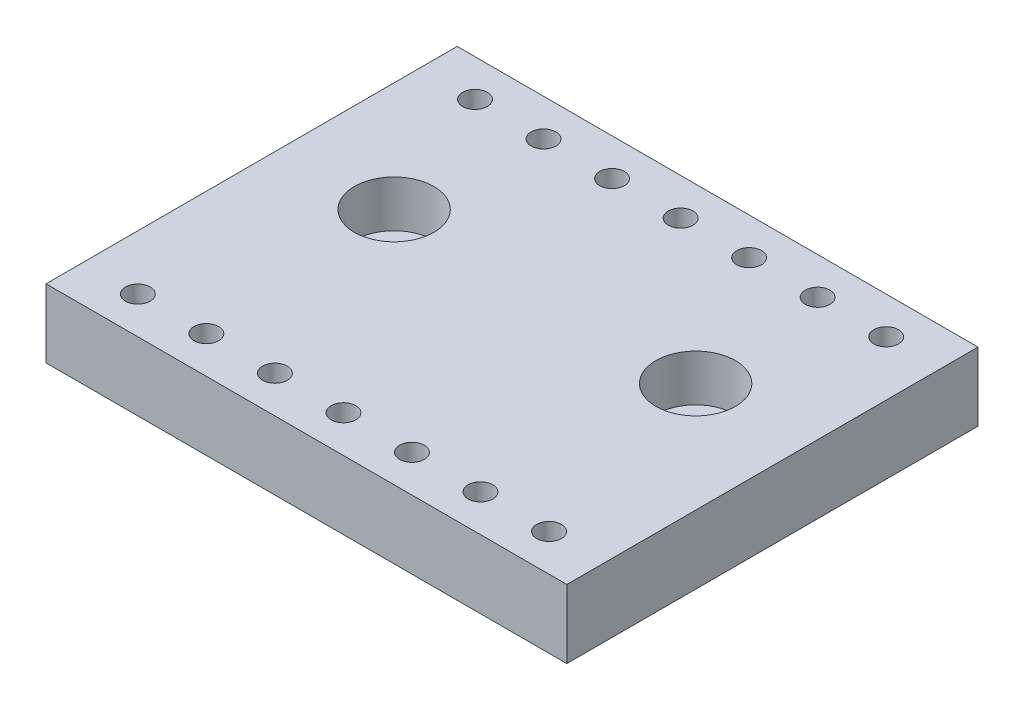
ISO-10303-21;
HEADER;
FILE_DESCRIPTION(('STEP AP214'),'2;1');
FILE_NAME('part.step','',(''),(''),'','','');
FILE_SCHEMA(('AUTOMOTIVE_DESIGN { 1 0 10303 214 1 1 1 1 }'));
ENDSEC;
DATA;
#1=APPLICATION_CONTEXT('core data for automotive mechanical design processes');
#2=APPLICATION_PROTOCOL_DEFINITION('international standard','automotive_design',2000,#1);
#3=PRODUCT_CONTEXT('',#1,'mechanical');
#4=PRODUCT('Part','Part','',(#3));
#5=PRODUCT_RELATED_PRODUCT_CATEGORY('part','',(#4));
#6=PRODUCT_DEFINITION_FORMATION('','',#4);
#7=PRODUCT_DEFINITION_CONTEXT('part definition',#1,'design');
#8=PRODUCT_DEFINITION('design','',#6,#7);
#9=PRODUCT_DEFINITION_SHAPE('','',#8);
#10=(LENGTH_UNIT() NAMED_UNIT(*) SI_UNIT(.MILLI.,.METRE.));
#11=(NAMED_UNIT(*) PLANE_ANGLE_UNIT() SI_UNIT($,.RADIAN.));
#12=(NAMED_UNIT(*) SI_UNIT($,.STERADIAN.) SOLID_ANGLE_UNIT());
#13=UNCERTAINTY_MEASURE_WITH_UNIT(LENGTH_MEASURE(1.E-05),#10,'distance_accuracy_value','');
#14=(GEOMETRIC_REPRESENTATION_CONTEXT(3) GLOBAL_UNCERTAINTY_ASSIGNED_CONTEXT((#13)) GLOBAL_UNIT_ASSIGNED_CONTEXT((#10,
#11,#12)) REPRESENTATION_CONTEXT('',''));
#15=CARTESIAN_POINT('',(0.,0.,0.));
#16=DIRECTION('',(0.,0.,1.));
#17=DIRECTION('',(1.,0.,0.));
#18=AXIS2_PLACEMENT_3D('',#15,#16,#17);
#19=CARTESIAN_POINT('',(24.13,-6.35,-19.05));
#20=DIRECTION('',(1.,0.,0.));
#21=DIRECTION('',(0.,0.,-1.));
#22=AXIS2_PLACEMENT_3D('',#19,#20,#21);
#23=PLANE('',#22);
#24=DIRECTION('',(0.,0.,-1.));
#25=VECTOR('',#24,1.);
#26=CARTESIAN_POINT('',(24.13,0.,-19.05));
#27=LINE('',#26,#25);
#28=CARTESIAN_POINT('',(24.13,0.,19.05));
#29=VERTEX_POINT('',#28);
#30=CARTESIAN_POINT('',(24.13,0.,-19.05));
#31=VERTEX_POINT('',#30);
#32=EDGE_CURVE('E105',#29,#31,#27,.T.);
#33=ORIENTED_EDGE('',*,*,#32,.F.);
#34=DIRECTION('',(0.,1.,0.));
#35=VECTOR('',#34,1.);
#36=CARTESIAN_POINT('',(24.13,-6.35,19.05));
#37=LINE('',#36,#35);
#38=CARTESIAN_POINT('',(24.13,-6.35,19.05));
#39=VERTEX_POINT('',#38);
#40=EDGE_CURVE('E52',#39,#29,#37,.T.);
#41=ORIENTED_EDGE('',*,*,#40,.F.);
#42=DIRECTION('',(0.,0.,-1.));
#43=VECTOR('',#42,1.);
#44=CARTESIAN_POINT('',(24.13,-6.35,-19.05));
#45=LINE('',#44,#43);
#46=CARTESIAN_POINT('',(24.13,-6.35,-19.05));
#47=VERTEX_POINT('',#46);
#48=EDGE_CURVE('E98',#39,#47,#45,.T.);
#49=ORIENTED_EDGE('',*,*,#48,.T.);
#50=DIRECTION('',(0.,1.,0.));
#51=VECTOR('',#50,1.);
#52=CARTESIAN_POINT('',(24.13,-6.35,-19.05));
#53=LINE('',#52,#51);
#54=EDGE_CURVE('E80',#47,#31,#53,.T.);
#55=ORIENTED_EDGE('',*,*,#54,.T.);
#56=EDGE_LOOP('',(#33,#41,#49,#55));
#57=FACE_BOUND('',#56,.T.);
#58=ADVANCED_FACE('F35',(#57),#23,.T.);
#59=CARTESIAN_POINT('',(-24.13,-6.35,19.05));
#60=DIRECTION('',(0.,0.,1.));
#61=DIRECTION('',(1.,0.,0.));
#62=AXIS2_PLACEMENT_3D('',#59,#60,#61);
#63=PLANE('',#62);
#64=DIRECTION('',(1.,0.,0.));
#65=VECTOR('',#64,1.);
#66=CARTESIAN_POINT('',(-24.13,0.,19.05));
#67=LINE('',#66,#65);
#68=CARTESIAN_POINT('',(-24.13,0.,19.05));
#69=VERTEX_POINT('',#68);
#70=EDGE_CURVE('E100',#69,#29,#67,.T.);
#71=ORIENTED_EDGE('',*,*,#70,.F.);
#72=DIRECTION('',(0.,1.,0.));
#73=VECTOR('',#72,1.);
#74=CARTESIAN_POINT('',(-24.13,-6.35,19.05));
#75=LINE('',#74,#73);
#76=CARTESIAN_POINT('',(-24.13,-6.35,19.05));
#77=VERTEX_POINT('',#76);
#78=EDGE_CURVE('E69',#77,#69,#75,.T.);
#79=ORIENTED_EDGE('',*,*,#78,.F.);
#80=DIRECTION('',(1.,0.,0.));
#81=VECTOR('',#80,1.);
#82=CARTESIAN_POINT('',(-24.13,-6.35,19.05));
#83=LINE('',#82,#81);
#84=EDGE_CURVE('E95',#77,#39,#83,.T.);
#85=ORIENTED_EDGE('',*,*,#84,.T.);
#86=ORIENTED_EDGE('',*,*,#40,.T.);
#87=EDGE_LOOP('',(#71,#79,#85,#86));
#88=FACE_BOUND('',#87,.T.);
#89=ADVANCED_FACE('F193',(#88),#63,.T.);
#90=CARTESIAN_POINT('',(-24.13,-6.35,-19.05));
#91=DIRECTION('',(-1.,0.,0.));
#92=DIRECTION('',(0.,0.,1.));
#93=AXIS2_PLACEMENT_3D('',#90,#91,#92);
#94=PLANE('',#93);
#95=DIRECTION('',(0.,0.,1.));
#96=VECTOR('',#95,1.);
#97=CARTESIAN_POINT('',(-24.13,0.,-19.05));
#98=LINE('',#97,#96);
#99=CARTESIAN_POINT('',(-24.13,0.,-19.05));
#100=VERTEX_POINT('',#99);
#101=EDGE_CURVE('E88',#100,#69,#98,.T.);
#102=ORIENTED_EDGE('',*,*,#101,.F.);
#103=DIRECTION('',(0.,1.,0.));
#104=VECTOR('',#103,1.);
#105=CARTESIAN_POINT('',(-24.13,-6.35,-19.05));
#106=LINE('',#105,#104);
#107=CARTESIAN_POINT('',(-24.13,-6.35,-19.05));
#108=VERTEX_POINT('',#107);
#109=EDGE_CURVE('E83',#108,#100,#106,.T.);
#110=ORIENTED_EDGE('',*,*,#109,.F.);
#111=DIRECTION('',(0.,0.,1.));
#112=VECTOR('',#111,1.);
#113=CARTESIAN_POINT('',(-24.13,-6.35,-19.05));
#114=LINE('',#113,#112);
#115=EDGE_CURVE('E86',#108,#77,#114,.T.);
#116=ORIENTED_EDGE('',*,*,#115,.T.);
#117=ORIENTED_EDGE('',*,*,#78,.T.);
#118=EDGE_LOOP('',(#102,#110,#116,#117));
#119=FACE_BOUND('',#118,.T.);
#120=ADVANCED_FACE('F85',(#119),#94,.T.);
#121=CARTESIAN_POINT('',(-24.13,-6.35,-19.05));
#122=DIRECTION('',(0.,0.,-1.));
#123=DIRECTION('',(-1.,0.,0.));
#124=AXIS2_PLACEMENT_3D('',#121,#122,#123);
#125=PLANE('',#124);
#126=DIRECTION('',(-1.,0.,0.));
#127=VECTOR('',#126,1.);
#128=CARTESIAN_POINT('',(-24.13,0.,-19.05));
#129=LINE('',#128,#127);
#130=EDGE_CURVE('E108',#31,#100,#129,.T.);
#131=ORIENTED_EDGE('',*,*,#130,.F.);
#132=ORIENTED_EDGE('',*,*,#54,.F.);
#133=DIRECTION('',(-1.,0.,0.));
#134=VECTOR('',#133,1.);
#135=CARTESIAN_POINT('',(-24.13,-6.35,-19.05));
#136=LINE('',#135,#134);
#137=EDGE_CURVE('E94',#47,#108,#136,.T.);
#138=ORIENTED_EDGE('',*,*,#137,.T.);
#139=ORIENTED_EDGE('',*,*,#109,.T.);
#140=EDGE_LOOP('',(#131,#132,#138,#139));
#141=FACE_BOUND('',#140,.T.);
#142=ADVANCED_FACE('F97',(#141),#125,.T.);
#143=CARTESIAN_POINT('',(0.,-6.35,0.));
#144=DIRECTION('',(0.,1.,0.));
#145=DIRECTION('',(0.,0.,1.));
#146=AXIS2_PLACEMENT_3D('',#143,#144,#145);
#147=PLANE('',#146);
#148=CARTESIAN_POINT('',(13.97,-6.35,-3.048));
#149=DIRECTION('',(0.,1.,0.));
#150=DIRECTION('',(0.,0.,1.));
#151=AXIS2_PLACEMENT_3D('',#148,#149,#150);
#152=CIRCLE('',#151,2.159);
#153=CARTESIAN_POINT('',(13.97,-6.35,-0.888999999999999));
#154=VERTEX_POINT('',#153);
#155=EDGE_CURVE('E327',#154,#154,#152,.F.);
#156=ORIENTED_EDGE('',*,*,#155,.F.);
#157=EDGE_LOOP('',(#156));
#158=FACE_BOUND('',#157,.T.);
#159=CARTESIAN_POINT('',(-12.7,-6.35,-15.621));
#160=DIRECTION('',(0.,1.,0.));
#161=DIRECTION('',(0.,0.,1.));
#162=AXIS2_PLACEMENT_3D('',#159,#160,#161);
#163=CIRCLE('',#162,1.143);
#164=CARTESIAN_POINT('',(-12.7,-6.35,-14.478));
#165=VERTEX_POINT('',#164);
#166=EDGE_CURVE('E318',#165,#165,#163,.T.);
#167=ORIENTED_EDGE('',*,*,#166,.T.);
#168=EDGE_LOOP('',(#167));
#169=FACE_BOUND('',#168,.T.);
#170=CARTESIAN_POINT('',(-12.7,-6.35,15.621));
#171=DIRECTION('',(0.,1.,0.));
#172=DIRECTION('',(0.,0.,1.));
#173=AXIS2_PLACEMENT_3D('',#170,#171,#172);
#174=CIRCLE('',#173,1.143);
#175=CARTESIAN_POINT('',(-12.7,-6.35,16.764));
#176=VERTEX_POINT('',#175);
#177=EDGE_CURVE('E312',#176,#176,#174,.T.);
#178=ORIENTED_EDGE('',*,*,#177,.T.);
#179=EDGE_LOOP('',(#178));
#180=FACE_BOUND('',#179,.T.);
#181=CARTESIAN_POINT('',(-19.05,-6.35,15.621));
#182=DIRECTION('',(0.,1.,0.));
#183=DIRECTION('',(0.,0.,1.));
#184=AXIS2_PLACEMENT_3D('',#181,#182,#183);
#185=CIRCLE('',#184,1.143);
#186=CARTESIAN_POINT('',(-19.05,-6.35,16.764));
#187=VERTEX_POINT('',#186);
#188=EDGE_CURVE('E306',#187,#187,#185,.T.);
#189=ORIENTED_EDGE('',*,*,#188,.T.);
#190=EDGE_LOOP('',(#189));
#191=FACE_BOUND('',#190,.T.);
#192=CARTESIAN_POINT('',(-19.05,-6.35,-15.621));
#193=DIRECTION('',(0.,1.,0.));
#194=DIRECTION('',(0.,0.,1.));
#195=AXIS2_PLACEMENT_3D('',#192,#193,#194);
#196=CIRCLE('',#195,1.143);
#197=CARTESIAN_POINT('',(-19.05,-6.35,-14.478));
#198=VERTEX_POINT('',#197);
#199=EDGE_CURVE('E300',#198,#198,#196,.T.);
#200=ORIENTED_EDGE('',*,*,#199,.T.);
#201=EDGE_LOOP('',(#200));
#202=FACE_BOUND('',#201,.T.);
#203=CARTESIAN_POINT('',(-13.97,-6.35,-3.048));
#204=DIRECTION('',(0.,1.,0.));
#205=DIRECTION('',(0.,0.,1.));
#206=AXIS2_PLACEMENT_3D('',#203,#204,#205);
#207=CIRCLE('',#206,2.159);
#208=CARTESIAN_POINT('',(-13.97,-6.35,-0.888999999999999));
#209=VERTEX_POINT('',#208);
#210=EDGE_CURVE('E295',#209,#209,#207,.T.);
#211=ORIENTED_EDGE('',*,*,#210,.T.);
#212=EDGE_LOOP('',(#211));
#213=FACE_BOUND('',#212,.T.);
#214=ORIENTED_EDGE('',*,*,#48,.F.);
#215=ORIENTED_EDGE('',*,*,#84,.F.);
#216=ORIENTED_EDGE('',*,*,#115,.F.);
#217=ORIENTED_EDGE('',*,*,#137,.F.);
#218=EDGE_LOOP('',(#214,#215,#216,#217));
#219=FACE_BOUND('',#218,.T.);
#220=CARTESIAN_POINT('',(-6.35,-6.35,15.621));
#221=DIRECTION('',(0.,1.,0.));
#222=DIRECTION('',(0.,0.,1.));
#223=AXIS2_PLACEMENT_3D('',#220,#221,#222);
#224=CIRCLE('',#223,1.143);
#225=CARTESIAN_POINT('',(-6.35,-6.35,16.764));
#226=VERTEX_POINT('',#225);
#227=EDGE_CURVE('E120',#226,#226,#224,.T.);
#228=ORIENTED_EDGE('',*,*,#227,.T.);
#229=EDGE_LOOP('',(#228));
#230=FACE_BOUND('',#229,.T.);
#231=CARTESIAN_POINT('',(0.,-6.35,15.621));
#232=DIRECTION('',(0.,1.,0.));
#233=DIRECTION('',(0.,0.,1.));
#234=AXIS2_PLACEMENT_3D('',#231,#232,#233);
#235=CIRCLE('',#234,1.143);
#236=CARTESIAN_POINT('',(0.,-6.35,16.764));
#237=VERTEX_POINT('',#236);
#238=EDGE_CURVE('E126',#237,#237,#235,.T.);
#239=ORIENTED_EDGE('',*,*,#238,.T.);
#240=EDGE_LOOP('',(#239));
#241=FACE_BOUND('',#240,.T.);
#242=CARTESIAN_POINT('',(6.35,-6.35,15.621));
#243=DIRECTION('',(0.,1.,0.));
#244=DIRECTION('',(0.,0.,1.));
#245=AXIS2_PLACEMENT_3D('',#242,#243,#244);
#246=CIRCLE('',#245,1.143);
#247=CARTESIAN_POINT('',(6.35,-6.35,16.764));
#248=VERTEX_POINT('',#247);
#249=EDGE_CURVE('E132',#248,#248,#246,.T.);
#250=ORIENTED_EDGE('',*,*,#249,.T.);
#251=EDGE_LOOP('',(#250));
#252=FACE_BOUND('',#251,.T.);
#253=CARTESIAN_POINT('',(12.7,-6.35,15.621));
#254=DIRECTION('',(0.,1.,0.));
#255=DIRECTION('',(0.,0.,1.));
#256=AXIS2_PLACEMENT_3D('',#253,#254,#255);
#257=CIRCLE('',#256,1.143);
#258=CARTESIAN_POINT('',(12.7,-6.35,16.764));
#259=VERTEX_POINT('',#258);
#260=EDGE_CURVE('E138',#259,#259,#257,.T.);
#261=ORIENTED_EDGE('',*,*,#260,.T.);
#262=EDGE_LOOP('',(#261));
#263=FACE_BOUND('',#262,.T.);
#264=CARTESIAN_POINT('',(19.05,-6.35,15.621));
#265=DIRECTION('',(0.,1.,0.));
#266=DIRECTION('',(0.,0.,1.));
#267=AXIS2_PLACEMENT_3D('',#264,#265,#266);
#268=CIRCLE('',#267,1.143);
#269=CARTESIAN_POINT('',(19.05,-6.35,16.764));
#270=VERTEX_POINT('',#269);
#271=EDGE_CURVE('E144',#270,#270,#268,.T.);
#272=ORIENTED_EDGE('',*,*,#271,.T.);
#273=EDGE_LOOP('',(#272));
#274=FACE_BOUND('',#273,.T.);
#275=CARTESIAN_POINT('',(-6.35,-6.35,-15.621));
#276=DIRECTION('',(0.,1.,0.));
#277=DIRECTION('',(0.,0.,1.));
#278=AXIS2_PLACEMENT_3D('',#275,#276,#277);
#279=CIRCLE('',#278,1.143);
#280=CARTESIAN_POINT('',(-6.35,-6.35,-14.478));
#281=VERTEX_POINT('',#280);
#282=EDGE_CURVE('E150',#281,#281,#279,.T.);
#283=ORIENTED_EDGE('',*,*,#282,.T.);
#284=EDGE_LOOP('',(#283));
#285=FACE_BOUND('',#284,.T.);
#286=CARTESIAN_POINT('',(0.,-6.35,-15.621));
#287=DIRECTION('',(0.,1.,0.));
#288=DIRECTION('',(0.,0.,1.));
#289=AXIS2_PLACEMENT_3D('',#286,#287,#288);
#290=CIRCLE('',#289,1.143);
#291=CARTESIAN_POINT('',(0.,-6.35,-14.478));
#292=VERTEX_POINT('',#291);
#293=EDGE_CURVE('E156',#292,#292,#290,.T.);
#294=ORIENTED_EDGE('',*,*,#293,.T.);
#295=EDGE_LOOP('',(#294));
#296=FACE_BOUND('',#295,.T.);
#297=CARTESIAN_POINT('',(6.35,-6.35,-15.621));
#298=DIRECTION('',(0.,1.,0.));
#299=DIRECTION('',(0.,0.,1.));
#300=AXIS2_PLACEMENT_3D('',#297,#298,#299);
#301=CIRCLE('',#300,1.143);
#302=CARTESIAN_POINT('',(6.35,-6.35,-14.478));
#303=VERTEX_POINT('',#302);
#304=EDGE_CURVE('E162',#303,#303,#301,.T.);
#305=ORIENTED_EDGE('',*,*,#304,.T.);
#306=EDGE_LOOP('',(#305));
#307=FACE_BOUND('',#306,.T.);
#308=CARTESIAN_POINT('',(12.7,-6.35,-15.621));
#309=DIRECTION('',(0.,1.,0.));
#310=DIRECTION('',(0.,0.,1.));
#311=AXIS2_PLACEMENT_3D('',#308,#309,#310);
#312=CIRCLE('',#311,1.143);
#313=CARTESIAN_POINT('',(12.7,-6.35,-14.478));
#314=VERTEX_POINT('',#313);
#315=EDGE_CURVE('E168',#314,#314,#312,.T.);
#316=ORIENTED_EDGE('',*,*,#315,.T.);
#317=EDGE_LOOP('',(#316));
#318=FACE_BOUND('',#317,.T.);
#319=CARTESIAN_POINT('',(19.05,-6.35,-15.621));
#320=DIRECTION('',(0.,1.,0.));
#321=DIRECTION('',(0.,0.,1.));
#322=AXIS2_PLACEMENT_3D('',#319,#320,#321);
#323=CIRCLE('',#322,1.143);
#324=CARTESIAN_POINT('',(19.05,-6.35,-14.478));
#325=VERTEX_POINT('',#324);
#326=EDGE_CURVE('E11',#325,#325,#323,.T.);
#327=ORIENTED_EDGE('',*,*,#326,.T.);
#328=EDGE_LOOP('',(#327));
#329=FACE_BOUND('',#328,.T.);
#330=ADVANCED_FACE('F92',(#158,#169,#180,#191,#202,#213,#219,#230,#241,#252,#263,#274,#285,#296,
#307,#318,#329),#147,.F.);
#331=CARTESIAN_POINT('',(0.,0.,0.));
#332=DIRECTION('',(0.,1.,0.));
#333=DIRECTION('',(0.,0.,1.));
#334=AXIS2_PLACEMENT_3D('',#331,#332,#333);
#335=PLANE('',#334);
#336=CARTESIAN_POINT('',(13.97,0.,-3.048));
#337=DIRECTION('',(0.,-1.,0.));
#338=DIRECTION('',(0.,0.,1.));
#339=AXIS2_PLACEMENT_3D('',#336,#337,#338);
#340=CIRCLE('',#339,3.683);
#341=CARTESIAN_POINT('',(13.97,0.,0.635000000000003));
#342=VERTEX_POINT('',#341);
#343=EDGE_CURVE('E325',#342,#342,#340,.T.);
#344=ORIENTED_EDGE('',*,*,#343,.T.);
#345=EDGE_LOOP('',(#344));
#346=FACE_BOUND('',#345,.T.);
#347=CARTESIAN_POINT('',(-12.7,0.,-15.621));
#348=DIRECTION('',(0.,1.,0.));
#349=DIRECTION('',(0.,0.,1.));
#350=AXIS2_PLACEMENT_3D('',#347,#348,#349);
#351=CIRCLE('',#350,1.143);
#352=CARTESIAN_POINT('',(-12.7,0.,-14.478));
#353=VERTEX_POINT('',#352);
#354=EDGE_CURVE('E321',#353,#353,#351,.T.);
#355=ORIENTED_EDGE('',*,*,#354,.F.);
#356=EDGE_LOOP('',(#355));
#357=FACE_BOUND('',#356,.T.);
#358=CARTESIAN_POINT('',(-12.7,0.,15.621));
#359=DIRECTION('',(0.,1.,0.));
#360=DIRECTION('',(0.,0.,1.));
#361=AXIS2_PLACEMENT_3D('',#358,#359,#360);
#362=CIRCLE('',#361,1.143);
#363=CARTESIAN_POINT('',(-12.7,0.,16.764));
#364=VERTEX_POINT('',#363);
#365=EDGE_CURVE('E315',#364,#364,#362,.T.);
#366=ORIENTED_EDGE('',*,*,#365,.F.);
#367=EDGE_LOOP('',(#366));
#368=FACE_BOUND('',#367,.T.);
#369=CARTESIAN_POINT('',(-19.05,0.,15.621));
#370=DIRECTION('',(0.,1.,0.));
#371=DIRECTION('',(0.,0.,1.));
#372=AXIS2_PLACEMENT_3D('',#369,#370,#371);
#373=CIRCLE('',#372,1.143);
#374=CARTESIAN_POINT('',(-19.05,0.,16.764));
#375=VERTEX_POINT('',#374);
#376=EDGE_CURVE('E309',#375,#375,#373,.T.);
#377=ORIENTED_EDGE('',*,*,#376,.F.);
#378=EDGE_LOOP('',(#377));
#379=FACE_BOUND('',#378,.T.);
#380=CARTESIAN_POINT('',(-19.05,0.,-15.621));
#381=DIRECTION('',(0.,1.,0.));
#382=DIRECTION('',(0.,0.,1.));
#383=AXIS2_PLACEMENT_3D('',#380,#381,#382);
#384=CIRCLE('',#383,1.143);
#385=CARTESIAN_POINT('',(-19.05,0.,-14.478));
#386=VERTEX_POINT('',#385);
#387=EDGE_CURVE('E303',#386,#386,#384,.T.);
#388=ORIENTED_EDGE('',*,*,#387,.F.);
#389=EDGE_LOOP('',(#388));
#390=FACE_BOUND('',#389,.T.);
#391=CARTESIAN_POINT('',(-13.97,0.,-3.048));
#392=DIRECTION('',(0.,1.,0.));
#393=DIRECTION('',(0.,0.,1.));
#394=AXIS2_PLACEMENT_3D('',#391,#392,#393);
#395=CIRCLE('',#394,3.683);
#396=CARTESIAN_POINT('',(-13.97,0.,0.635000000000003));
#397=VERTEX_POINT('',#396);
#398=EDGE_CURVE('E292',#397,#397,#395,.T.);
#399=ORIENTED_EDGE('',*,*,#398,.F.);
#400=EDGE_LOOP('',(#399));
#401=FACE_BOUND('',#400,.T.);
#402=ORIENTED_EDGE('',*,*,#32,.T.);
#403=ORIENTED_EDGE('',*,*,#130,.T.);
#404=ORIENTED_EDGE('',*,*,#101,.T.);
#405=ORIENTED_EDGE('',*,*,#70,.T.);
#406=EDGE_LOOP('',(#402,#403,#404,#405));
#407=FACE_BOUND('',#406,.T.);
#408=CARTESIAN_POINT('',(-6.35,0.,15.621));
#409=DIRECTION('',(0.,1.,0.));
#410=DIRECTION('',(0.,0.,1.));
#411=AXIS2_PLACEMENT_3D('',#408,#409,#410);
#412=CIRCLE('',#411,1.143);
#413=CARTESIAN_POINT('',(-6.35,0.,16.764));
#414=VERTEX_POINT('',#413);
#415=EDGE_CURVE('E115',#414,#414,#412,.T.);
#416=ORIENTED_EDGE('',*,*,#415,.F.);
#417=EDGE_LOOP('',(#416));
#418=FACE_BOUND('',#417,.T.);
#419=CARTESIAN_POINT('',(0.,0.,15.621));
#420=DIRECTION('',(0.,1.,0.));
#421=DIRECTION('',(0.,0.,1.));
#422=AXIS2_PLACEMENT_3D('',#419,#420,#421);
#423=CIRCLE('',#422,1.143);
#424=CARTESIAN_POINT('',(0.,0.,16.764));
#425=VERTEX_POINT('',#424);
#426=EDGE_CURVE('E123',#425,#425,#423,.T.);
#427=ORIENTED_EDGE('',*,*,#426,.F.);
#428=EDGE_LOOP('',(#427));
#429=FACE_BOUND('',#428,.T.);
#430=CARTESIAN_POINT('',(6.35,0.,15.621));
#431=DIRECTION('',(0.,1.,0.));
#432=DIRECTION('',(0.,0.,1.));
#433=AXIS2_PLACEMENT_3D('',#430,#431,#432);
#434=CIRCLE('',#433,1.143);
#435=CARTESIAN_POINT('',(6.35,0.,16.764));
#436=VERTEX_POINT('',#435);
#437=EDGE_CURVE('E129',#436,#436,#434,.T.);
#438=ORIENTED_EDGE('',*,*,#437,.F.);
#439=EDGE_LOOP('',(#438));
#440=FACE_BOUND('',#439,.T.);
#441=CARTESIAN_POINT('',(12.7,0.,15.621));
#442=DIRECTION('',(0.,1.,0.));
#443=DIRECTION('',(0.,0.,1.));
#444=AXIS2_PLACEMENT_3D('',#441,#442,#443);
#445=CIRCLE('',#444,1.143);
#446=CARTESIAN_POINT('',(12.7,0.,16.764));
#447=VERTEX_POINT('',#446);
#448=EDGE_CURVE('E135',#447,#447,#445,.T.);
#449=ORIENTED_EDGE('',*,*,#448,.F.);
#450=EDGE_LOOP('',(#449));
#451=FACE_BOUND('',#450,.T.);
#452=CARTESIAN_POINT('',(19.05,0.,15.621));
#453=DIRECTION('',(0.,1.,0.));
#454=DIRECTION('',(0.,0.,1.));
#455=AXIS2_PLACEMENT_3D('',#452,#453,#454);
#456=CIRCLE('',#455,1.143);
#457=CARTESIAN_POINT('',(19.05,0.,16.764));
#458=VERTEX_POINT('',#457);
#459=EDGE_CURVE('E141',#458,#458,#456,.T.);
#460=ORIENTED_EDGE('',*,*,#459,.F.);
#461=EDGE_LOOP('',(#460));
#462=FACE_BOUND('',#461,.T.);
#463=CARTESIAN_POINT('',(-6.35,0.,-15.621));
#464=DIRECTION('',(0.,1.,0.));
#465=DIRECTION('',(0.,0.,1.));
#466=AXIS2_PLACEMENT_3D('',#463,#464,#465);
#467=CIRCLE('',#466,1.143);
#468=CARTESIAN_POINT('',(-6.35,0.,-14.478));
#469=VERTEX_POINT('',#468);
#470=EDGE_CURVE('E147',#469,#469,#467,.T.);
#471=ORIENTED_EDGE('',*,*,#470,.F.);
#472=EDGE_LOOP('',(#471));
#473=FACE_BOUND('',#472,.T.);
#474=CARTESIAN_POINT('',(0.,0.,-15.621));
#475=DIRECTION('',(0.,1.,0.));
#476=DIRECTION('',(0.,0.,1.));
#477=AXIS2_PLACEMENT_3D('',#474,#475,#476);
#478=CIRCLE('',#477,1.143);
#479=CARTESIAN_POINT('',(0.,0.,-14.478));
#480=VERTEX_POINT('',#479);
#481=EDGE_CURVE('E153',#480,#480,#478,.T.);
#482=ORIENTED_EDGE('',*,*,#481,.F.);
#483=EDGE_LOOP('',(#482));
#484=FACE_BOUND('',#483,.T.);
#485=CARTESIAN_POINT('',(6.35,0.,-15.621));
#486=DIRECTION('',(0.,1.,0.));
#487=DIRECTION('',(0.,0.,1.));
#488=AXIS2_PLACEMENT_3D('',#485,#486,#487);
#489=CIRCLE('',#488,1.143);
#490=CARTESIAN_POINT('',(6.35,0.,-14.478));
#491=VERTEX_POINT('',#490);
#492=EDGE_CURVE('E159',#491,#491,#489,.T.);
#493=ORIENTED_EDGE('',*,*,#492,.F.);
#494=EDGE_LOOP('',(#493));
#495=FACE_BOUND('',#494,.T.);
#496=CARTESIAN_POINT('',(12.7,0.,-15.621));
#497=DIRECTION('',(0.,1.,0.));
#498=DIRECTION('',(0.,0.,1.));
#499=AXIS2_PLACEMENT_3D('',#496,#497,#498);
#500=CIRCLE('',#499,1.143);
#501=CARTESIAN_POINT('',(12.7,0.,-14.478));
#502=VERTEX_POINT('',#501);
#503=EDGE_CURVE('E165',#502,#502,#500,.T.);
#504=ORIENTED_EDGE('',*,*,#503,.F.);
#505=EDGE_LOOP('',(#504));
#506=FACE_BOUND('',#505,.T.);
#507=CARTESIAN_POINT('',(19.05,0.,-15.621));
#508=DIRECTION('',(0.,1.,0.));
#509=DIRECTION('',(0.,0.,1.));
#510=AXIS2_PLACEMENT_3D('',#507,#508,#509);
#511=CIRCLE('',#510,1.143);
#512=CARTESIAN_POINT('',(19.05,0.,-14.478));
#513=VERTEX_POINT('',#512);
#514=EDGE_CURVE('E44',#513,#513,#511,.T.);
#515=ORIENTED_EDGE('',*,*,#514,.F.);
#516=EDGE_LOOP('',(#515));
#517=FACE_BOUND('',#516,.T.);
#518=ADVANCED_FACE('F175',(#346,#357,#368,#379,#390,#401,#407,#418,#429,#440,#451,#462,#473,
#484,#495,#506,#517),#335,.T.);
#519=CARTESIAN_POINT('',(-13.97,-4.318,-3.048));
#520=DIRECTION('',(0.,1.,0.));
#521=DIRECTION('',(0.,0.,1.));
#522=AXIS2_PLACEMENT_3D('',#519,#520,#521);
#523=CYLINDRICAL_SURFACE('',#522,3.683);
#524=CARTESIAN_POINT('',(-13.97,-4.318,-3.048));
#525=DIRECTION('',(0.,1.,0.));
#526=DIRECTION('',(0.,0.,1.));
#527=AXIS2_PLACEMENT_3D('',#524,#525,#526);
#528=CIRCLE('',#527,3.683);
#529=CARTESIAN_POINT('',(-13.97,-4.318,0.635000000000003));
#530=VERTEX_POINT('',#529);
#531=EDGE_CURVE('E109',#530,#530,#528,.T.);
#532=ORIENTED_EDGE('',*,*,#531,.F.);
#533=EDGE_LOOP('',(#532));
#534=FACE_BOUND('',#533,.T.);
#535=ORIENTED_EDGE('',*,*,#398,.T.);
#536=EDGE_LOOP('',(#535));
#537=FACE_BOUND('',#536,.T.);
#538=ADVANCED_FACE('F177',(#534,#537),#523,.F.);
#539=CARTESIAN_POINT('',(-13.97,-4.318,-3.048));
#540=DIRECTION('',(0.,1.,0.));
#541=DIRECTION('',(0.,0.,1.));
#542=AXIS2_PLACEMENT_3D('',#539,#540,#541);
#543=PLANE('',#542);
#544=CARTESIAN_POINT('',(-13.97,-4.318,-3.048));
#545=DIRECTION('',(0.,1.,0.));
#546=DIRECTION('',(0.,0.,1.));
#547=AXIS2_PLACEMENT_3D('',#544,#545,#546);
#548=CIRCLE('',#547,2.159);
#549=CARTESIAN_POINT('',(-13.97,-4.318,-0.888999999999999));
#550=VERTEX_POINT('',#549);
#551=EDGE_CURVE('E289',#550,#550,#548,.T.);
#552=ORIENTED_EDGE('',*,*,#551,.F.);
#553=EDGE_LOOP('',(#552));
#554=FACE_BOUND('',#553,.T.);
#555=ORIENTED_EDGE('',*,*,#531,.T.);
#556=EDGE_LOOP('',(#555));
#557=FACE_BOUND('',#556,.T.);
#558=ADVANCED_FACE('F184',(#554,#557),#543,.T.);
#559=CARTESIAN_POINT('',(-13.97,-8.636,-3.048));
#560=DIRECTION('',(0.,1.,0.));
#561=DIRECTION('',(0.,0.,1.));
#562=AXIS2_PLACEMENT_3D('',#559,#560,#561);
#563=CYLINDRICAL_SURFACE('',#562,2.159);
#564=ORIENTED_EDGE('',*,*,#551,.T.);
#565=EDGE_LOOP('',(#564));
#566=FACE_BOUND('',#565,.T.);
#567=ORIENTED_EDGE('',*,*,#210,.F.);
#568=EDGE_LOOP('',(#567));
#569=FACE_BOUND('',#568,.T.);
#570=ADVANCED_FACE('F277',(#566,#569),#563,.F.);
#571=CARTESIAN_POINT('',(-19.05,-9.398,-15.621));
#572=DIRECTION('',(0.,1.,0.));
#573=DIRECTION('',(0.,0.,1.));
#574=AXIS2_PLACEMENT_3D('',#571,#572,#573);
#575=CYLINDRICAL_SURFACE('',#574,1.143);
#576=ORIENTED_EDGE('',*,*,#387,.T.);
#577=EDGE_LOOP('',(#576));
#578=FACE_BOUND('',#577,.T.);
#579=ORIENTED_EDGE('',*,*,#199,.F.);
#580=EDGE_LOOP('',(#579));
#581=FACE_BOUND('',#580,.T.);
#582=ADVANCED_FACE('F273',(#578,#581),#575,.F.);
#583=CARTESIAN_POINT('',(-19.05,-9.398,15.621));
#584=DIRECTION('',(0.,1.,0.));
#585=DIRECTION('',(0.,0.,1.));
#586=AXIS2_PLACEMENT_3D('',#583,#584,#585);
#587=CYLINDRICAL_SURFACE('',#586,1.143);
#588=ORIENTED_EDGE('',*,*,#376,.T.);
#589=EDGE_LOOP('',(#588));
#590=FACE_BOUND('',#589,.T.);
#591=ORIENTED_EDGE('',*,*,#188,.F.);
#592=EDGE_LOOP('',(#591));
#593=FACE_BOUND('',#592,.T.);
#594=ADVANCED_FACE('F269',(#590,#593),#587,.F.);
#595=CARTESIAN_POINT('',(-12.7,-9.398,15.621));
#596=DIRECTION('',(0.,1.,0.));
#597=DIRECTION('',(0.,0.,1.));
#598=AXIS2_PLACEMENT_3D('',#595,#596,#597);
#599=CYLINDRICAL_SURFACE('',#598,1.143);
#600=ORIENTED_EDGE('',*,*,#365,.T.);
#601=EDGE_LOOP('',(#600));
#602=FACE_BOUND('',#601,.T.);
#603=ORIENTED_EDGE('',*,*,#177,.F.);
#604=EDGE_LOOP('',(#603));
#605=FACE_BOUND('',#604,.T.);
#606=ADVANCED_FACE('F205',(#602,#605),#599,.F.);
#607=CARTESIAN_POINT('',(-6.35,-9.398,15.621));
#608=DIRECTION('',(0.,1.,0.));
#609=DIRECTION('',(0.,0.,1.));
#610=AXIS2_PLACEMENT_3D('',#607,#608,#609);
#611=CYLINDRICAL_SURFACE('',#610,1.143);
#612=ORIENTED_EDGE('',*,*,#415,.T.);
#613=EDGE_LOOP('',(#612));
#614=FACE_BOUND('',#613,.T.);
#615=ORIENTED_EDGE('',*,*,#227,.F.);
#616=EDGE_LOOP('',(#615));
#617=FACE_BOUND('',#616,.T.);
#618=ADVANCED_FACE('F201',(#614,#617),#611,.F.);
#619=CARTESIAN_POINT('',(0.,-9.398,15.621));
#620=DIRECTION('',(0.,1.,0.));
#621=DIRECTION('',(0.,0.,1.));
#622=AXIS2_PLACEMENT_3D('',#619,#620,#621);
#623=CYLINDRICAL_SURFACE('',#622,1.143);
#624=ORIENTED_EDGE('',*,*,#426,.T.);
#625=EDGE_LOOP('',(#624));
#626=FACE_BOUND('',#625,.T.);
#627=ORIENTED_EDGE('',*,*,#238,.F.);
#628=EDGE_LOOP('',(#627));
#629=FACE_BOUND('',#628,.T.);
#630=ADVANCED_FACE('F204',(#626,#629),#623,.F.);
#631=CARTESIAN_POINT('',(6.35,-9.398,15.621));
#632=DIRECTION('',(0.,1.,0.));
#633=DIRECTION('',(0.,0.,1.));
#634=AXIS2_PLACEMENT_3D('',#631,#632,#633);
#635=CYLINDRICAL_SURFACE('',#634,1.143);
#636=ORIENTED_EDGE('',*,*,#437,.T.);
#637=EDGE_LOOP('',(#636));
#638=FACE_BOUND('',#637,.T.);
#639=ORIENTED_EDGE('',*,*,#249,.F.);
#640=EDGE_LOOP('',(#639));
#641=FACE_BOUND('',#640,.T.);
#642=ADVANCED_FACE('F209',(#638,#641),#635,.F.);
#643=CARTESIAN_POINT('',(12.7,-9.398,15.621));
#644=DIRECTION('',(0.,1.,0.));
#645=DIRECTION('',(0.,0.,1.));
#646=AXIS2_PLACEMENT_3D('',#643,#644,#645);
#647=CYLINDRICAL_SURFACE('',#646,1.143);
#648=ORIENTED_EDGE('',*,*,#448,.T.);
#649=EDGE_LOOP('',(#648));
#650=FACE_BOUND('',#649,.T.);
#651=ORIENTED_EDGE('',*,*,#260,.F.);
#652=EDGE_LOOP('',(#651));
#653=FACE_BOUND('',#652,.T.);
#654=ADVANCED_FACE('F213',(#650,#653),#647,.F.);
#655=CARTESIAN_POINT('',(19.05,-9.398,15.621));
#656=DIRECTION('',(0.,1.,0.));
#657=DIRECTION('',(0.,0.,1.));
#658=AXIS2_PLACEMENT_3D('',#655,#656,#657);
#659=CYLINDRICAL_SURFACE('',#658,1.143);
#660=ORIENTED_EDGE('',*,*,#459,.T.);
#661=EDGE_LOOP('',(#660));
#662=FACE_BOUND('',#661,.T.);
#663=ORIENTED_EDGE('',*,*,#271,.F.);
#664=EDGE_LOOP('',(#663));
#665=FACE_BOUND('',#664,.T.);
#666=ADVANCED_FACE('F217',(#662,#665),#659,.F.);
#667=CARTESIAN_POINT('',(-12.7,-9.398,-15.621));
#668=DIRECTION('',(0.,1.,0.));
#669=DIRECTION('',(0.,0.,1.));
#670=AXIS2_PLACEMENT_3D('',#667,#668,#669);
#671=CYLINDRICAL_SURFACE('',#670,1.143);
#672=ORIENTED_EDGE('',*,*,#354,.T.);
#673=EDGE_LOOP('',(#672));
#674=FACE_BOUND('',#673,.T.);
#675=ORIENTED_EDGE('',*,*,#166,.F.);
#676=EDGE_LOOP('',(#675));
#677=FACE_BOUND('',#676,.T.);
#678=ADVANCED_FACE('F221',(#674,#677),#671,.F.);
#679=CARTESIAN_POINT('',(-6.35,-9.398,-15.621));
#680=DIRECTION('',(0.,1.,0.));
#681=DIRECTION('',(0.,0.,1.));
#682=AXIS2_PLACEMENT_3D('',#679,#680,#681);
#683=CYLINDRICAL_SURFACE('',#682,1.143);
#684=ORIENTED_EDGE('',*,*,#470,.T.);
#685=EDGE_LOOP('',(#684));
#686=FACE_BOUND('',#685,.T.);
#687=ORIENTED_EDGE('',*,*,#282,.F.);
#688=EDGE_LOOP('',(#687));
#689=FACE_BOUND('',#688,.T.);
#690=ADVANCED_FACE('F223',(#686,#689),#683,.F.);
#691=CARTESIAN_POINT('',(0.,-9.398,-15.621));
#692=DIRECTION('',(0.,1.,0.));
#693=DIRECTION('',(0.,0.,1.));
#694=AXIS2_PLACEMENT_3D('',#691,#692,#693);
#695=CYLINDRICAL_SURFACE('',#694,1.143);
#696=ORIENTED_EDGE('',*,*,#481,.T.);
#697=EDGE_LOOP('',(#696));
#698=FACE_BOUND('',#697,.T.);
#699=ORIENTED_EDGE('',*,*,#293,.F.);
#700=EDGE_LOOP('',(#699));
#701=FACE_BOUND('',#700,.T.);
#702=ADVANCED_FACE('F226',(#698,#701),#695,.F.);
#703=CARTESIAN_POINT('',(6.35,-9.398,-15.621));
#704=DIRECTION('',(0.,1.,0.));
#705=DIRECTION('',(0.,0.,1.));
#706=AXIS2_PLACEMENT_3D('',#703,#704,#705);
#707=CYLINDRICAL_SURFACE('',#706,1.143);
#708=ORIENTED_EDGE('',*,*,#492,.T.);
#709=EDGE_LOOP('',(#708));
#710=FACE_BOUND('',#709,.T.);
#711=ORIENTED_EDGE('',*,*,#304,.F.);
#712=EDGE_LOOP('',(#711));
#713=FACE_BOUND('',#712,.T.);
#714=ADVANCED_FACE('F230',(#710,#713),#707,.F.);
#715=CARTESIAN_POINT('',(12.7,-9.398,-15.621));
#716=DIRECTION('',(0.,1.,0.));
#717=DIRECTION('',(0.,0.,1.));
#718=AXIS2_PLACEMENT_3D('',#715,#716,#717);
#719=CYLINDRICAL_SURFACE('',#718,1.143);
#720=ORIENTED_EDGE('',*,*,#503,.T.);
#721=EDGE_LOOP('',(#720));
#722=FACE_BOUND('',#721,.T.);
#723=ORIENTED_EDGE('',*,*,#315,.F.);
#724=EDGE_LOOP('',(#723));
#725=FACE_BOUND('',#724,.T.);
#726=ADVANCED_FACE('F233',(#722,#725),#719,.F.);
#727=CARTESIAN_POINT('',(19.05,-9.398,-15.621));
#728=DIRECTION('',(0.,1.,0.));
#729=DIRECTION('',(0.,0.,1.));
#730=AXIS2_PLACEMENT_3D('',#727,#728,#729);
#731=CYLINDRICAL_SURFACE('',#730,1.143);
#732=ORIENTED_EDGE('',*,*,#514,.T.);
#733=EDGE_LOOP('',(#732));
#734=FACE_BOUND('',#733,.T.);
#735=ORIENTED_EDGE('',*,*,#326,.F.);
#736=EDGE_LOOP('',(#735));
#737=FACE_BOUND('',#736,.T.);
#738=ADVANCED_FACE('F37',(#734,#737),#731,.F.);
#739=CARTESIAN_POINT('',(13.97,-4.318,-3.048));
#740=DIRECTION('',(0.,1.,0.));
#741=DIRECTION('',(0.,0.,1.));
#742=AXIS2_PLACEMENT_3D('',#739,#740,#741);
#743=CYLINDRICAL_SURFACE('',#742,3.683);
#744=CARTESIAN_POINT('',(13.97,-4.318,-3.048));
#745=DIRECTION('',(0.,-1.,0.));
#746=DIRECTION('',(0.,0.,1.));
#747=AXIS2_PLACEMENT_3D('',#744,#745,#746);
#748=CIRCLE('',#747,3.683);
#749=CARTESIAN_POINT('',(13.97,-4.318,0.635000000000003));
#750=VERTEX_POINT('',#749);
#751=EDGE_CURVE('E324',#750,#750,#748,.T.);
#752=ORIENTED_EDGE('',*,*,#751,.T.);
#753=EDGE_LOOP('',(#752));
#754=FACE_BOUND('',#753,.T.);
#755=ORIENTED_EDGE('',*,*,#343,.F.);
#756=EDGE_LOOP('',(#755));
#757=FACE_BOUND('',#756,.T.);
#758=ADVANCED_FACE('F240',(#754,#757),#743,.F.);
#759=CARTESIAN_POINT('',(13.97,-4.318,-3.048));
#760=DIRECTION('',(0.,1.,0.));
#761=DIRECTION('',(0.,0.,1.));
#762=AXIS2_PLACEMENT_3D('',#759,#760,#761);
#763=PLANE('',#762);
#764=CARTESIAN_POINT('',(13.97,-4.318,-3.048));
#765=DIRECTION('',(0.,-1.,0.));
#766=DIRECTION('',(0.,0.,1.));
#767=AXIS2_PLACEMENT_3D('',#764,#765,#766);
#768=CIRCLE('',#767,2.159);
#769=CARTESIAN_POINT('',(13.97,-4.318,-0.888999999999999));
#770=VERTEX_POINT('',#769);
#771=EDGE_CURVE('E331',#770,#770,#768,.T.);
#772=ORIENTED_EDGE('',*,*,#771,.T.);
#773=EDGE_LOOP('',(#772));
#774=FACE_BOUND('',#773,.T.);
#775=ORIENTED_EDGE('',*,*,#751,.F.);
#776=EDGE_LOOP('',(#775));
#777=FACE_BOUND('',#776,.T.);
#778=ADVANCED_FACE('F251',(#774,#777),#763,.T.);
#779=CARTESIAN_POINT('',(13.97,-8.636,-3.048));
#780=DIRECTION('',(0.,1.,0.));
#781=DIRECTION('',(0.,0.,1.));
#782=AXIS2_PLACEMENT_3D('',#779,#780,#781);
#783=CYLINDRICAL_SURFACE('',#782,2.159);
#784=ORIENTED_EDGE('',*,*,#771,.F.);
#785=EDGE_LOOP('',(#784));
#786=FACE_BOUND('',#785,.T.);
#787=ORIENTED_EDGE('',*,*,#155,.T.);
#788=EDGE_LOOP('',(#787));
#789=FACE_BOUND('',#788,.T.);
#790=ADVANCED_FACE('F257',(#786,#789),#783,.F.);
#791=CLOSED_SHELL('',(#58,#89,#120,#142,#330,#518,#538,#558,#570,#582,#594,#606,#618,#630,#642,
#654,#666,#678,#690,#702,#714,#726,#738,#758,#778,#790));
#792=MANIFOLD_SOLID_BREP('B2',#791);
#793=ADVANCED_BREP_SHAPE_REPRESENTATION('',(#18,#792),#14);
#794=SHAPE_DEFINITION_REPRESENTATION(#9,#793);
ENDSEC;
END-ISO-10303-21;
